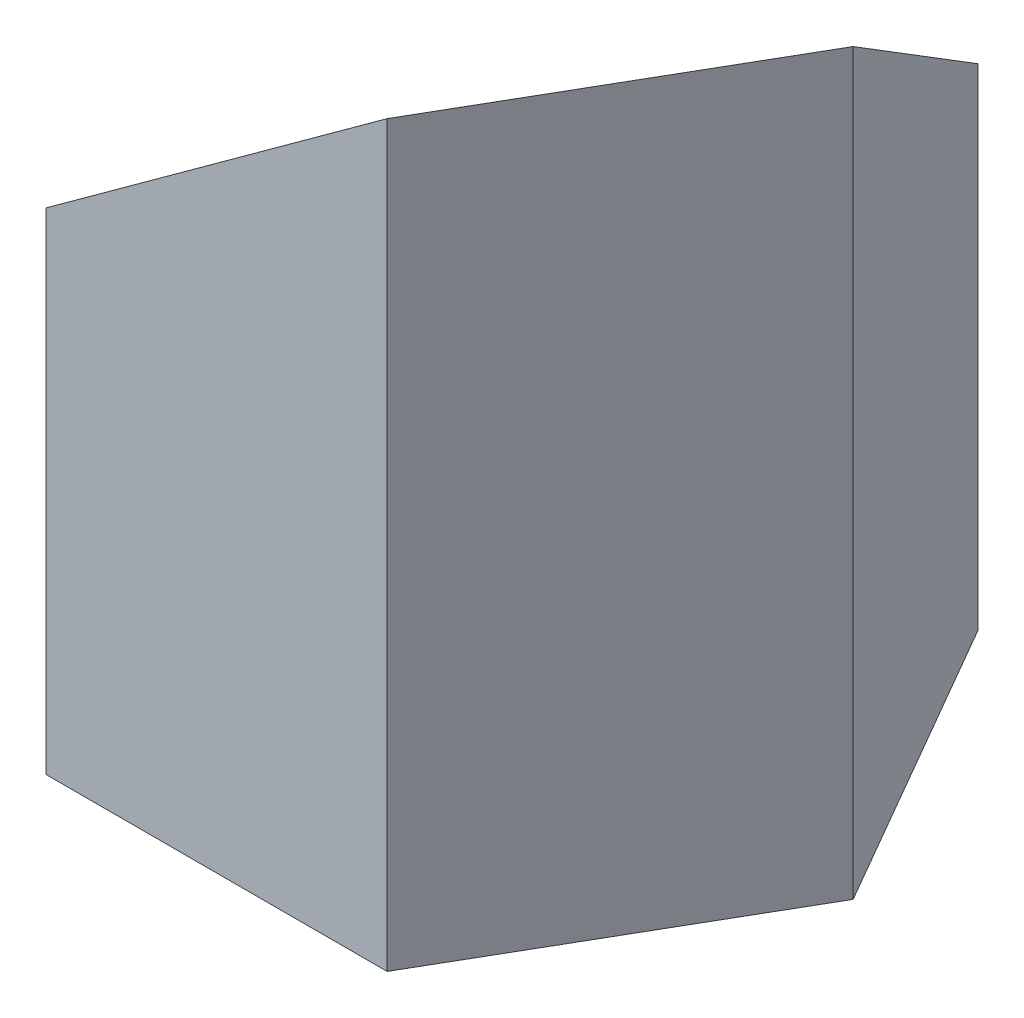
ISO-10303-21;
HEADER;
FILE_DESCRIPTION(('STEP AP214'),'2;1');
FILE_NAME('part.step','',(''),(''),'','','');
FILE_SCHEMA(('AUTOMOTIVE_DESIGN { 1 0 10303 214 1 1 1 1 }'));
ENDSEC;
DATA;
#1=APPLICATION_CONTEXT('core data for automotive mechanical design processes');
#2=APPLICATION_PROTOCOL_DEFINITION('international standard','automotive_design',2000,#1);
#3=PRODUCT_CONTEXT('',#1,'mechanical');
#4=PRODUCT('Part','Part','',(#3));
#5=PRODUCT_RELATED_PRODUCT_CATEGORY('part','',(#4));
#6=PRODUCT_DEFINITION_FORMATION('','',#4);
#7=PRODUCT_DEFINITION_CONTEXT('part definition',#1,'design');
#8=PRODUCT_DEFINITION('design','',#6,#7);
#9=PRODUCT_DEFINITION_SHAPE('','',#8);
#10=(LENGTH_UNIT() NAMED_UNIT(*) SI_UNIT(.MILLI.,.METRE.));
#11=(NAMED_UNIT(*) PLANE_ANGLE_UNIT() SI_UNIT($,.RADIAN.));
#12=(NAMED_UNIT(*) SI_UNIT($,.STERADIAN.) SOLID_ANGLE_UNIT());
#13=UNCERTAINTY_MEASURE_WITH_UNIT(LENGTH_MEASURE(1.E-05),#10,'distance_accuracy_value','');
#14=(GEOMETRIC_REPRESENTATION_CONTEXT(3) GLOBAL_UNCERTAINTY_ASSIGNED_CONTEXT((#13)) GLOBAL_UNIT_ASSIGNED_CONTEXT((#10,
#11,#12)) REPRESENTATION_CONTEXT('',''));
#15=CARTESIAN_POINT('',(0.,0.,0.));
#16=DIRECTION('',(0.,0.,1.));
#17=DIRECTION('',(1.,0.,0.));
#18=AXIS2_PLACEMENT_3D('',#15,#16,#17);
#19=CARTESIAN_POINT('',(23.094010767585,100.,40.));
#20=DIRECTION('',(-0.55667039922642,0.766044443118977,-0.32139380484327));
#21=DIRECTION('',(-0.808963493304012,-0.587858883152556,0.));
#22=AXIS2_PLACEMENT_3D('',#19,#20,#21);
#23=PLANE('',#22);
#24=DIRECTION('',(0.5,0.,-0.866025403784439));
#25=VECTOR('',#24,1.);
#26=CARTESIAN_POINT('',(23.094010767585,100.,40.));
#27=LINE('',#26,#25);
#28=CARTESIAN_POINT('',(23.094010767585,100.,40.));
#29=VERTEX_POINT('',#28);
#30=CARTESIAN_POINT('',(46.18802153517,100.,0.));
#31=VERTEX_POINT('',#30);
#32=EDGE_CURVE('E100',#29,#31,#27,.T.);
#33=ORIENTED_EDGE('',*,*,#32,.T.);
#34=DIRECTION('',(-0.404481746652006,-0.587858883152556,-0.700582935935477));
#35=VECTOR('',#34,1.);
#36=CARTESIAN_POINT('',(46.18802153517,100.,0.));
#37=LINE('',#36,#35);
#38=CARTESIAN_POINT('',(23.094010767585,66.4360147529087,-40.));
#39=VERTEX_POINT('',#38);
#40=EDGE_CURVE('E92',#31,#39,#37,.T.);
#41=ORIENTED_EDGE('',*,*,#40,.T.);
#42=DIRECTION('',(-0.808963493304011,-0.587858883152556,0.));
#43=VECTOR('',#42,1.);
#44=CARTESIAN_POINT('',(39.0555779452327,78.0349918786791,-40.));
#45=LINE('',#44,#43);
#46=CARTESIAN_POINT('',(-23.094010767585,32.8720295058174,-40.));
#47=VERTEX_POINT('',#46);
#48=EDGE_CURVE('E89',#39,#47,#45,.T.);
#49=ORIENTED_EDGE('',*,*,#48,.T.);
#50=DIRECTION('',(-0.5,0.,0.866025403784438));
#51=VECTOR('',#50,1.);
#52=CARTESIAN_POINT('',(-23.094010767585,32.8720295058174,-40.));
#53=LINE('',#52,#51);
#54=CARTESIAN_POINT('',(-46.1880215351701,32.8720295058174,0.));
#55=VERTEX_POINT('',#54);
#56=EDGE_CURVE('E157',#47,#55,#53,.T.);
#57=ORIENTED_EDGE('',*,*,#56,.T.);
#58=DIRECTION('',(0.404481746652006,0.587858883152556,0.700582935935477));
#59=VECTOR('',#58,1.);
#60=CARTESIAN_POINT('',(-30.2264543575223,56.0699837573581,27.6462453201096));
#61=LINE('',#60,#59);
#62=CARTESIAN_POINT('',(-23.094010767585,66.4360147529087,40.));
#63=VERTEX_POINT('',#62);
#64=EDGE_CURVE('E154',#55,#63,#61,.T.);
#65=ORIENTED_EDGE('',*,*,#64,.T.);
#66=DIRECTION('',(0.808963493304012,0.587858883152556,0.));
#67=VECTOR('',#66,1.);
#68=CARTESIAN_POINT('',(-7.13244358993729,78.0349918786791,40.));
#69=LINE('',#68,#67);
#70=EDGE_CURVE('E59',#63,#29,#69,.T.);
#71=ORIENTED_EDGE('',*,*,#70,.T.);
#72=EDGE_LOOP('',(#33,#41,#49,#57,#65,#71));
#73=FACE_BOUND('',#72,.T.);
#74=CARTESIAN_POINT('',(0.,66.4360147529087,0.));
#75=DIRECTION('',(-0.55667039922642,0.766044443118977,-0.32139380484327));
#76=DIRECTION('',(-0.663413948168938,-0.64278760968654,-0.383022221559488));
#77=AXIS2_PLACEMENT_3D('',#74,#75,#76);
#78=ELLIPSE('',#77,16.3175911166535,12.5);
#79=CARTESIAN_POINT('',(-10.8253175473055,55.9472693631927,-6.24999999999999));
#80=VERTEX_POINT('',#79);
#81=EDGE_CURVE('E43',#80,#80,#78,.T.);
#82=ORIENTED_EDGE('',*,*,#81,.F.);
#83=EDGE_LOOP('',(#82));
#84=FACE_BOUND('',#83,.T.);
#85=ADVANCED_FACE('F40',(#73,#84),#23,.T.);
#86=CARTESIAN_POINT('',(0.,0.,0.));
#87=DIRECTION('',(0.,1.,0.));
#88=DIRECTION('',(0.,0.,1.));
#89=AXIS2_PLACEMENT_3D('',#86,#87,#88);
#90=PLANE('',#89);
#91=DIRECTION('',(0.5,0.,-0.866025403784439));
#92=VECTOR('',#91,1.);
#93=CARTESIAN_POINT('',(23.094010767585,0.,40.));
#94=LINE('',#93,#92);
#95=CARTESIAN_POINT('',(23.094010767585,0.,40.));
#96=VERTEX_POINT('',#95);
#97=CARTESIAN_POINT('',(46.18802153517,0.,0.));
#98=VERTEX_POINT('',#97);
#99=EDGE_CURVE('E110',#96,#98,#94,.T.);
#100=ORIENTED_EDGE('',*,*,#99,.F.);
#101=DIRECTION('',(1.,0.,0.));
#102=VECTOR('',#101,1.);
#103=CARTESIAN_POINT('',(-23.094010767585,0.,40.));
#104=LINE('',#103,#102);
#105=CARTESIAN_POINT('',(-23.094010767585,0.,40.));
#106=VERTEX_POINT('',#105);
#107=EDGE_CURVE('E106',#106,#96,#104,.T.);
#108=ORIENTED_EDGE('',*,*,#107,.F.);
#109=DIRECTION('',(0.5,0.,0.866025403784439));
#110=VECTOR('',#109,1.);
#111=CARTESIAN_POINT('',(-46.1880215351701,0.,0.));
#112=LINE('',#111,#110);
#113=CARTESIAN_POINT('',(-46.1880215351701,0.,0.));
#114=VERTEX_POINT('',#113);
#115=EDGE_CURVE('E131',#114,#106,#112,.T.);
#116=ORIENTED_EDGE('',*,*,#115,.F.);
#117=DIRECTION('',(-0.5,0.,0.866025403784439));
#118=VECTOR('',#117,1.);
#119=CARTESIAN_POINT('',(-23.094010767585,0.,-40.));
#120=LINE('',#119,#118);
#121=CARTESIAN_POINT('',(-23.094010767585,0.,-40.));
#122=VERTEX_POINT('',#121);
#123=EDGE_CURVE('E128',#122,#114,#120,.T.);
#124=ORIENTED_EDGE('',*,*,#123,.F.);
#125=DIRECTION('',(-1.,0.,0.));
#126=VECTOR('',#125,1.);
#127=CARTESIAN_POINT('',(23.094010767585,0.,-40.));
#128=LINE('',#127,#126);
#129=CARTESIAN_POINT('',(23.094010767585,0.,-40.));
#130=VERTEX_POINT('',#129);
#131=EDGE_CURVE('E120',#130,#122,#128,.T.);
#132=ORIENTED_EDGE('',*,*,#131,.F.);
#133=DIRECTION('',(-0.5,0.,-0.866025403784439));
#134=VECTOR('',#133,1.);
#135=CARTESIAN_POINT('',(46.18802153517,0.,0.));
#136=LINE('',#135,#134);
#137=EDGE_CURVE('E115',#98,#130,#136,.T.);
#138=ORIENTED_EDGE('',*,*,#137,.F.);
#139=EDGE_LOOP('',(#100,#108,#116,#124,#132,#138));
#140=FACE_BOUND('',#139,.T.);
#141=CARTESIAN_POINT('',(0.,0.,0.));
#142=DIRECTION('',(0.,1.,0.));
#143=DIRECTION('',(0.,0.,1.));
#144=AXIS2_PLACEMENT_3D('',#141,#142,#143);
#145=CIRCLE('',#144,12.5);
#146=CARTESIAN_POINT('',(0.,0.,12.5));
#147=VERTEX_POINT('',#146);
#148=EDGE_CURVE('E123',#147,#147,#145,.T.);
#149=ORIENTED_EDGE('',*,*,#148,.T.);
#150=EDGE_LOOP('',(#149));
#151=FACE_BOUND('',#150,.T.);
#152=ADVANCED_FACE('F190',(#140,#151),#90,.F.);
#153=CARTESIAN_POINT('',(23.094010767585,100.,40.));
#154=DIRECTION('',(-0.866025403784439,0.,-0.5));
#155=DIRECTION('',(-0.5,0.,0.866025403784439));
#156=AXIS2_PLACEMENT_3D('',#153,#154,#155);
#157=PLANE('',#156);
#158=ORIENTED_EDGE('',*,*,#99,.T.);
#159=DIRECTION('',(0.,-1.,0.));
#160=VECTOR('',#159,1.);
#161=CARTESIAN_POINT('',(46.18802153517,100.,0.));
#162=LINE('',#161,#160);
#163=EDGE_CURVE('E11',#31,#98,#162,.T.);
#164=ORIENTED_EDGE('',*,*,#163,.F.);
#165=ORIENTED_EDGE('',*,*,#32,.F.);
#166=DIRECTION('',(0.,-1.,0.));
#167=VECTOR('',#166,1.);
#168=CARTESIAN_POINT('',(23.094010767585,100.,40.));
#169=LINE('',#168,#167);
#170=EDGE_CURVE('E111',#29,#96,#169,.T.);
#171=ORIENTED_EDGE('',*,*,#170,.T.);
#172=EDGE_LOOP('',(#158,#164,#165,#171));
#173=FACE_BOUND('',#172,.T.);
#174=ADVANCED_FACE('F108',(#173),#157,.F.);
#175=CARTESIAN_POINT('',(46.18802153517,100.,0.));
#176=DIRECTION('',(-0.866025403784439,0.,0.5));
#177=DIRECTION('',(0.5,0.,0.866025403784439));
#178=AXIS2_PLACEMENT_3D('',#175,#176,#177);
#179=PLANE('',#178);
#180=ORIENTED_EDGE('',*,*,#137,.T.);
#181=DIRECTION('',(0.,-1.,0.));
#182=VECTOR('',#181,1.);
#183=CARTESIAN_POINT('',(23.094010767585,100.,-40.));
#184=LINE('',#183,#182);
#185=EDGE_CURVE('E50',#39,#130,#184,.T.);
#186=ORIENTED_EDGE('',*,*,#185,.F.);
#187=ORIENTED_EDGE('',*,*,#40,.F.);
#188=ORIENTED_EDGE('',*,*,#163,.T.);
#189=EDGE_LOOP('',(#180,#186,#187,#188));
#190=FACE_BOUND('',#189,.T.);
#191=ADVANCED_FACE('F95',(#190),#179,.F.);
#192=CARTESIAN_POINT('',(23.094010767585,100.,-40.));
#193=DIRECTION('',(0.,0.,1.));
#194=DIRECTION('',(1.,0.,0.));
#195=AXIS2_PLACEMENT_3D('',#192,#193,#194);
#196=PLANE('',#195);
#197=ORIENTED_EDGE('',*,*,#131,.T.);
#198=DIRECTION('',(0.,-1.,0.));
#199=VECTOR('',#198,1.);
#200=CARTESIAN_POINT('',(-23.094010767585,100.,-40.));
#201=LINE('',#200,#199);
#202=EDGE_CURVE('E146',#47,#122,#201,.T.);
#203=ORIENTED_EDGE('',*,*,#202,.F.);
#204=ORIENTED_EDGE('',*,*,#48,.F.);
#205=ORIENTED_EDGE('',*,*,#185,.T.);
#206=EDGE_LOOP('',(#197,#203,#204,#205));
#207=FACE_BOUND('',#206,.T.);
#208=ADVANCED_FACE('F194',(#207),#196,.F.);
#209=CARTESIAN_POINT('',(-23.094010767585,100.,-40.));
#210=DIRECTION('',(0.866025403784439,0.,0.5));
#211=DIRECTION('',(0.5,0.,-0.866025403784439));
#212=AXIS2_PLACEMENT_3D('',#209,#210,#211);
#213=PLANE('',#212);
#214=ORIENTED_EDGE('',*,*,#123,.T.);
#215=DIRECTION('',(0.,-1.,0.));
#216=VECTOR('',#215,1.);
#217=CARTESIAN_POINT('',(-46.1880215351701,100.,0.));
#218=LINE('',#217,#216);
#219=EDGE_CURVE('E142',#55,#114,#218,.T.);
#220=ORIENTED_EDGE('',*,*,#219,.F.);
#221=ORIENTED_EDGE('',*,*,#56,.F.);
#222=ORIENTED_EDGE('',*,*,#202,.T.);
#223=EDGE_LOOP('',(#214,#220,#221,#222));
#224=FACE_BOUND('',#223,.T.);
#225=ADVANCED_FACE('F183',(#224),#213,.F.);
#226=CARTESIAN_POINT('',(-46.1880215351701,100.,0.));
#227=DIRECTION('',(0.866025403784439,0.,-0.5));
#228=DIRECTION('',(-0.5,0.,-0.866025403784439));
#229=AXIS2_PLACEMENT_3D('',#226,#227,#228);
#230=PLANE('',#229);
#231=ORIENTED_EDGE('',*,*,#115,.T.);
#232=DIRECTION('',(0.,-1.,0.));
#233=VECTOR('',#232,1.);
#234=CARTESIAN_POINT('',(-23.094010767585,100.,40.));
#235=LINE('',#234,#233);
#236=EDGE_CURVE('E138',#63,#106,#235,.T.);
#237=ORIENTED_EDGE('',*,*,#236,.F.);
#238=ORIENTED_EDGE('',*,*,#64,.F.);
#239=ORIENTED_EDGE('',*,*,#219,.T.);
#240=EDGE_LOOP('',(#231,#237,#238,#239));
#241=FACE_BOUND('',#240,.T.);
#242=ADVANCED_FACE('F187',(#241),#230,.F.);
#243=CARTESIAN_POINT('',(-23.094010767585,100.,40.));
#244=DIRECTION('',(0.,0.,-1.));
#245=DIRECTION('',(-1.,0.,0.));
#246=AXIS2_PLACEMENT_3D('',#243,#244,#245);
#247=PLANE('',#246);
#248=ORIENTED_EDGE('',*,*,#107,.T.);
#249=ORIENTED_EDGE('',*,*,#170,.F.);
#250=ORIENTED_EDGE('',*,*,#70,.F.);
#251=ORIENTED_EDGE('',*,*,#236,.T.);
#252=EDGE_LOOP('',(#248,#249,#250,#251));
#253=FACE_BOUND('',#252,.T.);
#254=ADVANCED_FACE('F189',(#253),#247,.F.);
#255=CARTESIAN_POINT('',(0.,100.,0.));
#256=DIRECTION('',(0.,-1.,0.));
#257=DIRECTION('',(0.,0.,-1.));
#258=AXIS2_PLACEMENT_3D('',#255,#256,#257);
#259=CYLINDRICAL_SURFACE('',#258,12.5);
#260=ORIENTED_EDGE('',*,*,#81,.T.);
#261=EDGE_LOOP('',(#260));
#262=FACE_BOUND('',#261,.T.);
#263=ORIENTED_EDGE('',*,*,#148,.F.);
#264=EDGE_LOOP('',(#263));
#265=FACE_BOUND('',#264,.T.);
#266=ADVANCED_FACE('F213',(#262,#265),#259,.F.);
#267=CLOSED_SHELL('',(#85,#152,#174,#191,#208,#225,#242,#254,#266));
#268=MANIFOLD_SOLID_BREP('B2',#267);
#269=ADVANCED_BREP_SHAPE_REPRESENTATION('',(#18,#268),#14);
#270=SHAPE_DEFINITION_REPRESENTATION(#9,#269);
ENDSEC;
END-ISO-10303-21;
